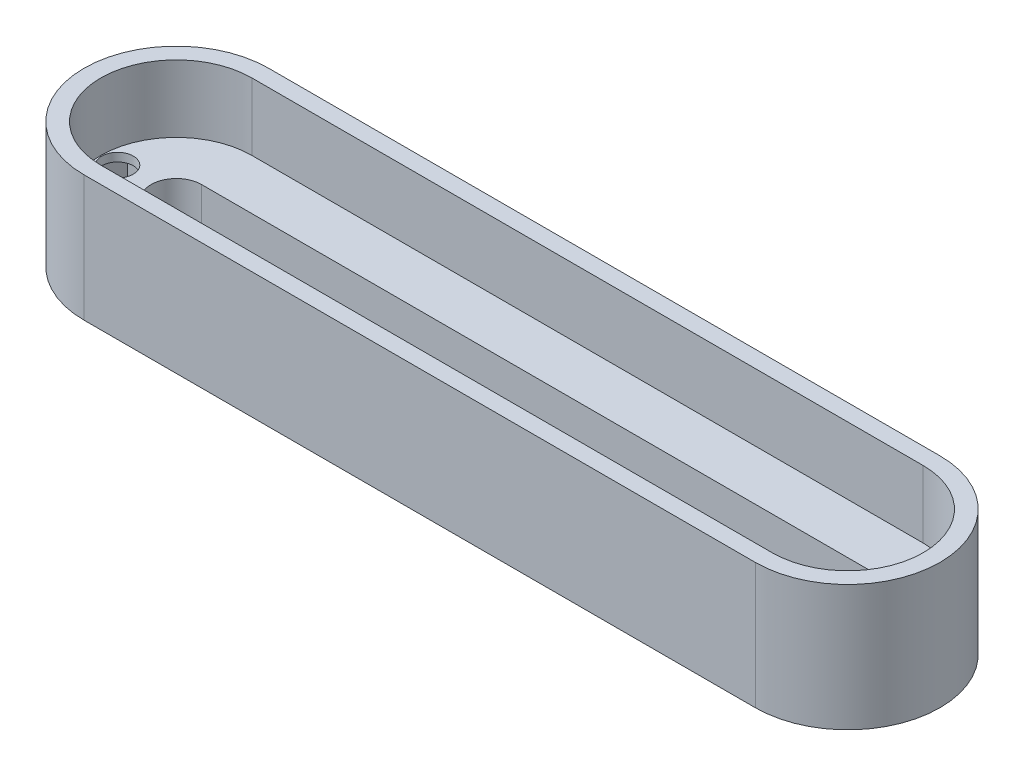
ISO-10303-21;
HEADER;
FILE_DESCRIPTION(('STEP AP214'),'2;1');
FILE_NAME('part.step','',(''),(''),'','','');
FILE_SCHEMA(('AUTOMOTIVE_DESIGN { 1 0 10303 214 1 1 1 1 }'));
ENDSEC;
DATA;
#1=APPLICATION_CONTEXT('core data for automotive mechanical design processes');
#2=APPLICATION_PROTOCOL_DEFINITION('international standard','automotive_design',2000,#1);
#3=PRODUCT_CONTEXT('',#1,'mechanical');
#4=PRODUCT('Part','Part','',(#3));
#5=PRODUCT_RELATED_PRODUCT_CATEGORY('part','',(#4));
#6=PRODUCT_DEFINITION_FORMATION('','',#4);
#7=PRODUCT_DEFINITION_CONTEXT('part definition',#1,'design');
#8=PRODUCT_DEFINITION('design','',#6,#7);
#9=PRODUCT_DEFINITION_SHAPE('','',#8);
#10=(LENGTH_UNIT() NAMED_UNIT(*) SI_UNIT(.MILLI.,.METRE.));
#11=(NAMED_UNIT(*) PLANE_ANGLE_UNIT() SI_UNIT($,.RADIAN.));
#12=(NAMED_UNIT(*) SI_UNIT($,.STERADIAN.) SOLID_ANGLE_UNIT());
#13=UNCERTAINTY_MEASURE_WITH_UNIT(LENGTH_MEASURE(1.E-05),#10,'distance_accuracy_value','');
#14=(GEOMETRIC_REPRESENTATION_CONTEXT(3) GLOBAL_UNCERTAINTY_ASSIGNED_CONTEXT((#13)) GLOBAL_UNIT_ASSIGNED_CONTEXT((#10,
#11,#12)) REPRESENTATION_CONTEXT('',''));
#15=CARTESIAN_POINT('',(0.,0.,0.));
#16=DIRECTION('',(0.,0.,1.));
#17=DIRECTION('',(1.,0.,0.));
#18=AXIS2_PLACEMENT_3D('',#15,#16,#17);
#19=CARTESIAN_POINT('',(-40.,12.,0.));
#20=DIRECTION('',(0.,-1.,0.));
#21=DIRECTION('',(0.,0.,-1.));
#22=AXIS2_PLACEMENT_3D('',#19,#20,#21);
#23=CYLINDRICAL_SURFACE('',#22,3.00000000000001);
#24=DIRECTION('',(0.,-1.,0.));
#25=VECTOR('',#24,1.);
#26=CARTESIAN_POINT('',(-40.,12.,-3.00000000000001));
#27=LINE('',#26,#25);
#28=CARTESIAN_POINT('',(-40.,7.,-3.00000000000001));
#29=VERTEX_POINT('',#28);
#30=CARTESIAN_POINT('',(-40.,0.,-3.00000000000001));
#31=VERTEX_POINT('',#30);
#32=EDGE_CURVE('E367',#29,#31,#27,.T.);
#33=ORIENTED_EDGE('',*,*,#32,.F.);
#34=CARTESIAN_POINT('',(-40.,7.,0.));
#35=DIRECTION('',(0.,1.,0.));
#36=DIRECTION('',(0.,0.,1.));
#37=AXIS2_PLACEMENT_3D('',#34,#35,#36);
#38=CIRCLE('',#37,3.00000000000001);
#39=CARTESIAN_POINT('',(-40.,7.,3.00000000000001));
#40=VERTEX_POINT('',#39);
#41=EDGE_CURVE('E51',#29,#40,#38,.T.);
#42=ORIENTED_EDGE('',*,*,#41,.T.);
#43=DIRECTION('',(0.,-1.,0.));
#44=VECTOR('',#43,1.);
#45=CARTESIAN_POINT('',(-40.,12.,3.00000000000001));
#46=LINE('',#45,#44);
#47=CARTESIAN_POINT('',(-40.,0.,3.00000000000001));
#48=VERTEX_POINT('',#47);
#49=EDGE_CURVE('E373',#40,#48,#46,.T.);
#50=ORIENTED_EDGE('',*,*,#49,.T.);
#51=CARTESIAN_POINT('',(-40.,0.,0.));
#52=DIRECTION('',(0.,1.,0.));
#53=DIRECTION('',(0.,0.,1.));
#54=AXIS2_PLACEMENT_3D('',#51,#52,#53);
#55=CIRCLE('',#54,3.00000000000001);
#56=EDGE_CURVE('E355',#31,#48,#55,.T.);
#57=ORIENTED_EDGE('',*,*,#56,.F.);
#58=EDGE_LOOP('',(#33,#42,#50,#57));
#59=FACE_BOUND('',#58,.T.);
#60=ADVANCED_FACE('F34',(#59),#23,.F.);
#61=CARTESIAN_POINT('',(-40.,12.,3.00000000000001));
#62=DIRECTION('',(0.,0.,-1.));
#63=DIRECTION('',(-1.,0.,0.));
#64=AXIS2_PLACEMENT_3D('',#61,#62,#63);
#65=PLANE('',#64);
#66=ORIENTED_EDGE('',*,*,#49,.F.);
#67=DIRECTION('',(1.,0.,0.));
#68=VECTOR('',#67,1.);
#69=CARTESIAN_POINT('',(-40.,7.,3.00000000000001));
#70=LINE('',#69,#68);
#71=CARTESIAN_POINT('',(40.,7.,3.));
#72=VERTEX_POINT('',#71);
#73=EDGE_CURVE('E244',#40,#72,#70,.T.);
#74=ORIENTED_EDGE('',*,*,#73,.T.);
#75=DIRECTION('',(0.,-1.,0.));
#76=VECTOR('',#75,1.);
#77=CARTESIAN_POINT('',(40.,12.,3.));
#78=LINE('',#77,#76);
#79=CARTESIAN_POINT('',(40.,0.,3.));
#80=VERTEX_POINT('',#79);
#81=EDGE_CURVE('E371',#72,#80,#78,.T.);
#82=ORIENTED_EDGE('',*,*,#81,.T.);
#83=DIRECTION('',(1.,0.,0.));
#84=VECTOR('',#83,1.);
#85=CARTESIAN_POINT('',(-40.,0.,3.00000000000001));
#86=LINE('',#85,#84);
#87=EDGE_CURVE('E358',#48,#80,#86,.T.);
#88=ORIENTED_EDGE('',*,*,#87,.F.);
#89=EDGE_LOOP('',(#66,#74,#82,#88));
#90=FACE_BOUND('',#89,.T.);
#91=ADVANCED_FACE('F471',(#90),#65,.T.);
#92=CARTESIAN_POINT('',(40.,12.,0.));
#93=DIRECTION('',(0.,-1.,0.));
#94=DIRECTION('',(0.,0.,-1.));
#95=AXIS2_PLACEMENT_3D('',#92,#93,#94);
#96=CYLINDRICAL_SURFACE('',#95,3.00000000000001);
#97=ORIENTED_EDGE('',*,*,#81,.F.);
#98=CARTESIAN_POINT('',(40.,7.,0.));
#99=DIRECTION('',(0.,1.,0.));
#100=DIRECTION('',(0.,0.,1.));
#101=AXIS2_PLACEMENT_3D('',#98,#99,#100);
#102=CIRCLE('',#101,3.00000000000001);
#103=CARTESIAN_POINT('',(40.,7.,-3.00000000000003));
#104=VERTEX_POINT('',#103);
#105=EDGE_CURVE('E241',#72,#104,#102,.T.);
#106=ORIENTED_EDGE('',*,*,#105,.T.);
#107=DIRECTION('',(0.,-1.,0.));
#108=VECTOR('',#107,1.);
#109=CARTESIAN_POINT('',(40.,12.,-3.00000000000003));
#110=LINE('',#109,#108);
#111=CARTESIAN_POINT('',(40.,0.,-3.00000000000003));
#112=VERTEX_POINT('',#111);
#113=EDGE_CURVE('E369',#104,#112,#110,.T.);
#114=ORIENTED_EDGE('',*,*,#113,.T.);
#115=CARTESIAN_POINT('',(40.,0.,0.));
#116=DIRECTION('',(0.,1.,0.));
#117=DIRECTION('',(0.,0.,1.));
#118=AXIS2_PLACEMENT_3D('',#115,#116,#117);
#119=CIRCLE('',#118,3.00000000000001);
#120=EDGE_CURVE('E361',#80,#112,#119,.T.);
#121=ORIENTED_EDGE('',*,*,#120,.F.);
#122=EDGE_LOOP('',(#97,#106,#114,#121));
#123=FACE_BOUND('',#122,.T.);
#124=ADVANCED_FACE('F477',(#123),#96,.F.);
#125=CARTESIAN_POINT('',(-40.,12.,-3.00000000000001));
#126=DIRECTION('',(0.,0.,1.));
#127=DIRECTION('',(1.,0.,0.));
#128=AXIS2_PLACEMENT_3D('',#125,#126,#127);
#129=PLANE('',#128);
#130=ORIENTED_EDGE('',*,*,#113,.F.);
#131=DIRECTION('',(-1.,0.,0.));
#132=VECTOR('',#131,1.);
#133=CARTESIAN_POINT('',(-40.,7.,-3.00000000000001));
#134=LINE('',#133,#132);
#135=EDGE_CURVE('E239',#104,#29,#134,.T.);
#136=ORIENTED_EDGE('',*,*,#135,.T.);
#137=ORIENTED_EDGE('',*,*,#32,.T.);
#138=DIRECTION('',(-1.,0.,0.));
#139=VECTOR('',#138,1.);
#140=CARTESIAN_POINT('',(-40.,0.,-3.00000000000001));
#141=LINE('',#140,#139);
#142=EDGE_CURVE('E364',#112,#31,#141,.T.);
#143=ORIENTED_EDGE('',*,*,#142,.F.);
#144=EDGE_LOOP('',(#130,#136,#137,#143));
#145=FACE_BOUND('',#144,.T.);
#146=ADVANCED_FACE('F525',(#145),#129,.T.);
#147=CARTESIAN_POINT('',(-47.,12.,0.));
#148=DIRECTION('',(0.,-1.,0.));
#149=DIRECTION('',(0.,0.,-1.));
#150=AXIS2_PLACEMENT_3D('',#147,#148,#149);
#151=CYLINDRICAL_SURFACE('',#150,1.875);
#152=CARTESIAN_POINT('',(-47.,6.,0.));
#153=DIRECTION('',(0.,1.,0.));
#154=DIRECTION('',(0.,0.,1.));
#155=AXIS2_PLACEMENT_3D('',#152,#153,#154);
#156=CIRCLE('',#155,1.875);
#157=CARTESIAN_POINT('',(-47.,6.,1.875));
#158=VERTEX_POINT('',#157);
#159=EDGE_CURVE('E265',#158,#158,#156,.T.);
#160=ORIENTED_EDGE('',*,*,#159,.F.);
#161=EDGE_LOOP('',(#160));
#162=FACE_BOUND('',#161,.T.);
#163=CARTESIAN_POINT('',(-47.,7.,0.));
#164=DIRECTION('',(0.,1.,0.));
#165=DIRECTION('',(0.,0.,1.));
#166=AXIS2_PLACEMENT_3D('',#163,#164,#165);
#167=CIRCLE('',#166,1.875);
#168=CARTESIAN_POINT('',(-47.,7.,1.875));
#169=VERTEX_POINT('',#168);
#170=EDGE_CURVE('E236',#169,#169,#167,.F.);
#171=ORIENTED_EDGE('',*,*,#170,.F.);
#172=EDGE_LOOP('',(#171));
#173=FACE_BOUND('',#172,.T.);
#174=ADVANCED_FACE('F522',(#162,#173),#151,.F.);
#175=CARTESIAN_POINT('',(47.,12.,0.));
#176=DIRECTION('',(0.,-1.,0.));
#177=DIRECTION('',(0.,0.,-1.));
#178=AXIS2_PLACEMENT_3D('',#175,#176,#177);
#179=CYLINDRICAL_SURFACE('',#178,1.875);
#180=CARTESIAN_POINT('',(47.,6.,0.));
#181=DIRECTION('',(0.,1.,0.));
#182=DIRECTION('',(0.,0.,1.));
#183=AXIS2_PLACEMENT_3D('',#180,#181,#182);
#184=CIRCLE('',#183,1.875);
#185=CARTESIAN_POINT('',(47.,6.,1.87500000000002));
#186=VERTEX_POINT('',#185);
#187=EDGE_CURVE('E260',#186,#186,#184,.F.);
#188=ORIENTED_EDGE('',*,*,#187,.T.);
#189=EDGE_LOOP('',(#188));
#190=FACE_BOUND('',#189,.T.);
#191=CARTESIAN_POINT('',(47.,7.,0.));
#192=DIRECTION('',(0.,1.,0.));
#193=DIRECTION('',(0.,0.,1.));
#194=AXIS2_PLACEMENT_3D('',#191,#192,#193);
#195=CIRCLE('',#194,1.875);
#196=CARTESIAN_POINT('',(47.,7.,1.87500000000002));
#197=VERTEX_POINT('',#196);
#198=EDGE_CURVE('E38',#197,#197,#195,.T.);
#199=ORIENTED_EDGE('',*,*,#198,.T.);
#200=EDGE_LOOP('',(#199));
#201=FACE_BOUND('',#200,.T.);
#202=ADVANCED_FACE('F396',(#190,#201),#179,.F.);
#203=CARTESIAN_POINT('',(-40.,0.,0.));
#204=DIRECTION('',(0.,1.,0.));
#205=DIRECTION('',(0.,0.,1.));
#206=AXIS2_PLACEMENT_3D('',#203,#204,#205);
#207=PLANE('',#206);
#208=ORIENTED_EDGE('',*,*,#56,.T.);
#209=ORIENTED_EDGE('',*,*,#87,.T.);
#210=ORIENTED_EDGE('',*,*,#120,.T.);
#211=ORIENTED_EDGE('',*,*,#142,.T.);
#212=EDGE_LOOP('',(#208,#209,#210,#211));
#213=FACE_BOUND('',#212,.T.);
#214=CARTESIAN_POINT('',(-40.,0.,0.));
#215=DIRECTION('',(0.,1.,0.));
#216=DIRECTION('',(0.,0.,1.));
#217=AXIS2_PLACEMENT_3D('',#214,#215,#216);
#218=CIRCLE('',#217,11.);
#219=CARTESIAN_POINT('',(-40.,0.,-11.));
#220=VERTEX_POINT('',#219);
#221=CARTESIAN_POINT('',(-40.,0.,11.));
#222=VERTEX_POINT('',#221);
#223=EDGE_CURVE('E375',#220,#222,#218,.T.);
#224=ORIENTED_EDGE('',*,*,#223,.F.);
#225=DIRECTION('',(-1.,0.,0.));
#226=VECTOR('',#225,1.);
#227=CARTESIAN_POINT('',(-40.,0.,-11.));
#228=LINE('',#227,#226);
#229=CARTESIAN_POINT('',(40.,0.,-11.));
#230=VERTEX_POINT('',#229);
#231=EDGE_CURVE('E382',#230,#220,#228,.T.);
#232=ORIENTED_EDGE('',*,*,#231,.F.);
#233=CARTESIAN_POINT('',(40.,0.,0.));
#234=DIRECTION('',(0.,1.,0.));
#235=DIRECTION('',(0.,0.,1.));
#236=AXIS2_PLACEMENT_3D('',#233,#234,#235);
#237=CIRCLE('',#236,11.);
#238=CARTESIAN_POINT('',(40.,0.,11.));
#239=VERTEX_POINT('',#238);
#240=EDGE_CURVE('E380',#239,#230,#237,.T.);
#241=ORIENTED_EDGE('',*,*,#240,.F.);
#242=DIRECTION('',(1.,0.,0.));
#243=VECTOR('',#242,1.);
#244=CARTESIAN_POINT('',(-40.,0.,11.));
#245=LINE('',#244,#243);
#246=EDGE_CURVE('E378',#222,#239,#245,.T.);
#247=ORIENTED_EDGE('',*,*,#246,.F.);
#248=EDGE_LOOP('',(#224,#232,#241,#247));
#249=FACE_BOUND('',#248,.T.);
#250=DIRECTION('',(0.499999999999999,0.,-0.866025403784439));
#251=VECTOR('',#250,1.);
#252=CARTESIAN_POINT('',(32.8500000000001,0.,18.9659563428792));
#253=LINE('',#252,#251);
#254=CARTESIAN_POINT('',(43.8,0.,0.));
#255=VERTEX_POINT('',#254);
#256=CARTESIAN_POINT('',(45.4,0.,-2.77128129211021));
#257=VERTEX_POINT('',#256);
#258=EDGE_CURVE('E312',#255,#257,#253,.T.);
#259=ORIENTED_EDGE('',*,*,#258,.F.);
#260=DIRECTION('',(-0.500000000000001,0.,-0.866025403784438));
#261=VECTOR('',#260,1.);
#262=CARTESIAN_POINT('',(32.85,0.,-18.9659563428792));
#263=LINE('',#262,#261);
#264=CARTESIAN_POINT('',(45.4,0.,2.77128129211019));
#265=VERTEX_POINT('',#264);
#266=EDGE_CURVE('E296',#265,#255,#263,.T.);
#267=ORIENTED_EDGE('',*,*,#266,.F.);
#268=DIRECTION('',(-1.,0.,0.));
#269=VECTOR('',#268,1.);
#270=CARTESIAN_POINT('',(0.,0.,2.77128129211018));
#271=LINE('',#270,#269);
#272=CARTESIAN_POINT('',(48.6,0.,2.77128129211019));
#273=VERTEX_POINT('',#272);
#274=EDGE_CURVE('E329',#273,#265,#271,.T.);
#275=ORIENTED_EDGE('',*,*,#274,.F.);
#276=DIRECTION('',(-0.499999999999999,0.,0.866025403784439));
#277=VECTOR('',#276,1.);
#278=CARTESIAN_POINT('',(37.65,0.,21.7372376349894));
#279=LINE('',#278,#277);
#280=CARTESIAN_POINT('',(50.2,0.,0.));
#281=VERTEX_POINT('',#280);
#282=EDGE_CURVE('E332',#281,#273,#279,.T.);
#283=ORIENTED_EDGE('',*,*,#282,.F.);
#284=DIRECTION('',(0.5,0.,0.866025403784438));
#285=VECTOR('',#284,1.);
#286=CARTESIAN_POINT('',(37.65,0.,-21.7372376349894));
#287=LINE('',#286,#285);
#288=CARTESIAN_POINT('',(48.6,0.,-2.77128129211021));
#289=VERTEX_POINT('',#288);
#290=EDGE_CURVE('E335',#289,#281,#287,.T.);
#291=ORIENTED_EDGE('',*,*,#290,.F.);
#292=DIRECTION('',(1.,0.,0.));
#293=VECTOR('',#292,1.);
#294=CARTESIAN_POINT('',(0.,0.,-2.7712812921102));
#295=LINE('',#294,#293);
#296=EDGE_CURVE('E338',#257,#289,#295,.T.);
#297=ORIENTED_EDGE('',*,*,#296,.F.);
#298=EDGE_LOOP('',(#259,#267,#275,#283,#291,#297));
#299=FACE_BOUND('',#298,.T.);
#300=DIRECTION('',(-0.499999999999999,0.,-0.866025403784439));
#301=VECTOR('',#300,1.);
#302=CARTESIAN_POINT('',(-43.8,0.,0.));
#303=LINE('',#302,#301);
#304=CARTESIAN_POINT('',(-43.8,0.,0.));
#305=VERTEX_POINT('',#304);
#306=CARTESIAN_POINT('',(-45.4,0.,-2.7712812921102));
#307=VERTEX_POINT('',#306);
#308=EDGE_CURVE('E293',#305,#307,#303,.T.);
#309=ORIENTED_EDGE('',*,*,#308,.T.);
#310=DIRECTION('',(-1.,0.,0.));
#311=VECTOR('',#310,1.);
#312=CARTESIAN_POINT('',(-45.4,0.,-2.7712812921102));
#313=LINE('',#312,#311);
#314=CARTESIAN_POINT('',(-48.6,0.,-2.7712812921102));
#315=VERTEX_POINT('',#314);
#316=EDGE_CURVE('E290',#307,#315,#313,.T.);
#317=ORIENTED_EDGE('',*,*,#316,.T.);
#318=DIRECTION('',(-0.5,0.,0.866025403784438));
#319=VECTOR('',#318,1.);
#320=CARTESIAN_POINT('',(-48.6,0.,-2.7712812921102));
#321=LINE('',#320,#319);
#322=CARTESIAN_POINT('',(-50.2,0.,0.));
#323=VERTEX_POINT('',#322);
#324=EDGE_CURVE('E287',#315,#323,#321,.T.);
#325=ORIENTED_EDGE('',*,*,#324,.T.);
#326=DIRECTION('',(0.499999999999999,0.,0.866025403784439));
#327=VECTOR('',#326,1.);
#328=CARTESIAN_POINT('',(-50.2,0.,0.));
#329=LINE('',#328,#327);
#330=CARTESIAN_POINT('',(-48.6,0.,2.7712812921102));
#331=VERTEX_POINT('',#330);
#332=EDGE_CURVE('E284',#323,#331,#329,.T.);
#333=ORIENTED_EDGE('',*,*,#332,.T.);
#334=DIRECTION('',(1.,0.,0.));
#335=VECTOR('',#334,1.);
#336=CARTESIAN_POINT('',(-48.6,0.,2.7712812921102));
#337=LINE('',#336,#335);
#338=CARTESIAN_POINT('',(-45.4,0.,2.7712812921102));
#339=VERTEX_POINT('',#338);
#340=EDGE_CURVE('E280',#331,#339,#337,.T.);
#341=ORIENTED_EDGE('',*,*,#340,.T.);
#342=DIRECTION('',(0.500000000000001,0.,-0.866025403784438));
#343=VECTOR('',#342,1.);
#344=CARTESIAN_POINT('',(-45.4,0.,2.7712812921102));
#345=LINE('',#344,#343);
#346=EDGE_CURVE('E277',#339,#305,#345,.T.);
#347=ORIENTED_EDGE('',*,*,#346,.T.);
#348=EDGE_LOOP('',(#309,#317,#325,#333,#341,#347));
#349=FACE_BOUND('',#348,.T.);
#350=ADVANCED_FACE('F429',(#213,#249,#299,#349),#207,.F.);
#351=CARTESIAN_POINT('',(-40.,12.,0.));
#352=DIRECTION('',(0.,-1.,0.));
#353=DIRECTION('',(0.,0.,-1.));
#354=AXIS2_PLACEMENT_3D('',#351,#352,#353);
#355=CYLINDRICAL_SURFACE('',#354,11.);
#356=ORIENTED_EDGE('',*,*,#223,.T.);
#357=DIRECTION('',(0.,-1.,0.));
#358=VECTOR('',#357,1.);
#359=CARTESIAN_POINT('',(-40.,12.,11.));
#360=LINE('',#359,#358);
#361=CARTESIAN_POINT('',(-40.,15.,11.));
#362=VERTEX_POINT('',#361);
#363=EDGE_CURVE('E11',#362,#222,#360,.T.);
#364=ORIENTED_EDGE('',*,*,#363,.F.);
#365=CARTESIAN_POINT('',(-40.,15.,0.));
#366=DIRECTION('',(0.,1.,0.));
#367=DIRECTION('',(0.,0.,1.));
#368=AXIS2_PLACEMENT_3D('',#365,#366,#367);
#369=CIRCLE('',#368,11.);
#370=CARTESIAN_POINT('',(-40.,15.,-11.));
#371=VERTEX_POINT('',#370);
#372=EDGE_CURVE('E257',#371,#362,#369,.T.);
#373=ORIENTED_EDGE('',*,*,#372,.F.);
#374=DIRECTION('',(0.,-1.,0.));
#375=VECTOR('',#374,1.);
#376=CARTESIAN_POINT('',(-40.,12.,-11.));
#377=LINE('',#376,#375);
#378=EDGE_CURVE('E384',#371,#220,#377,.T.);
#379=ORIENTED_EDGE('',*,*,#378,.T.);
#380=EDGE_LOOP('',(#356,#364,#373,#379));
#381=FACE_BOUND('',#380,.T.);
#382=ADVANCED_FACE('F36',(#381),#355,.T.);
#383=CARTESIAN_POINT('',(-40.,12.,11.));
#384=DIRECTION('',(0.,0.,-1.));
#385=DIRECTION('',(-1.,0.,0.));
#386=AXIS2_PLACEMENT_3D('',#383,#384,#385);
#387=PLANE('',#386);
#388=ORIENTED_EDGE('',*,*,#246,.T.);
#389=DIRECTION('',(0.,-1.,0.));
#390=VECTOR('',#389,1.);
#391=CARTESIAN_POINT('',(40.,12.,11.));
#392=LINE('',#391,#390);
#393=CARTESIAN_POINT('',(40.,15.,11.));
#394=VERTEX_POINT('',#393);
#395=EDGE_CURVE('E43',#394,#239,#392,.T.);
#396=ORIENTED_EDGE('',*,*,#395,.F.);
#397=DIRECTION('',(1.,0.,0.));
#398=VECTOR('',#397,1.);
#399=CARTESIAN_POINT('',(0.,15.,11.));
#400=LINE('',#399,#398);
#401=EDGE_CURVE('E248',#362,#394,#400,.T.);
#402=ORIENTED_EDGE('',*,*,#401,.F.);
#403=ORIENTED_EDGE('',*,*,#363,.T.);
#404=EDGE_LOOP('',(#388,#396,#402,#403));
#405=FACE_BOUND('',#404,.T.);
#406=ADVANCED_FACE('F489',(#405),#387,.F.);
#407=CARTESIAN_POINT('',(40.,12.,0.));
#408=DIRECTION('',(0.,-1.,0.));
#409=DIRECTION('',(0.,0.,-1.));
#410=AXIS2_PLACEMENT_3D('',#407,#408,#409);
#411=CYLINDRICAL_SURFACE('',#410,11.);
#412=ORIENTED_EDGE('',*,*,#240,.T.);
#413=DIRECTION('',(0.,-1.,0.));
#414=VECTOR('',#413,1.);
#415=CARTESIAN_POINT('',(40.,12.,-11.));
#416=LINE('',#415,#414);
#417=CARTESIAN_POINT('',(40.,15.,-11.));
#418=VERTEX_POINT('',#417);
#419=EDGE_CURVE('E387',#418,#230,#416,.T.);
#420=ORIENTED_EDGE('',*,*,#419,.F.);
#421=CARTESIAN_POINT('',(40.,15.,0.));
#422=DIRECTION('',(0.,1.,0.));
#423=DIRECTION('',(0.,0.,1.));
#424=AXIS2_PLACEMENT_3D('',#421,#422,#423);
#425=CIRCLE('',#424,11.);
#426=EDGE_CURVE('E251',#394,#418,#425,.T.);
#427=ORIENTED_EDGE('',*,*,#426,.F.);
#428=ORIENTED_EDGE('',*,*,#395,.T.);
#429=EDGE_LOOP('',(#412,#420,#427,#428));
#430=FACE_BOUND('',#429,.T.);
#431=ADVANCED_FACE('F486',(#430),#411,.T.);
#432=CARTESIAN_POINT('',(-40.,12.,-11.));
#433=DIRECTION('',(0.,0.,1.));
#434=DIRECTION('',(1.,0.,0.));
#435=AXIS2_PLACEMENT_3D('',#432,#433,#434);
#436=PLANE('',#435);
#437=ORIENTED_EDGE('',*,*,#231,.T.);
#438=ORIENTED_EDGE('',*,*,#378,.F.);
#439=DIRECTION('',(-1.,0.,0.));
#440=VECTOR('',#439,1.);
#441=CARTESIAN_POINT('',(0.,15.,-11.));
#442=LINE('',#441,#440);
#443=EDGE_CURVE('E254',#418,#371,#442,.T.);
#444=ORIENTED_EDGE('',*,*,#443,.F.);
#445=ORIENTED_EDGE('',*,*,#419,.T.);
#446=EDGE_LOOP('',(#437,#438,#444,#445));
#447=FACE_BOUND('',#446,.T.);
#448=ADVANCED_FACE('F483',(#447),#436,.F.);
#449=CARTESIAN_POINT('',(32.85,6.,-18.9659563428792));
#450=DIRECTION('',(-0.866025403784438,0.,0.500000000000001));
#451=DIRECTION('',(0.500000000000001,0.,0.866025403784438));
#452=AXIS2_PLACEMENT_3D('',#449,#450,#451);
#453=PLANE('',#452);
#454=ORIENTED_EDGE('',*,*,#266,.T.);
#455=DIRECTION('',(0.,-1.,0.));
#456=VECTOR('',#455,1.);
#457=CARTESIAN_POINT('',(43.8,6.,0.));
#458=LINE('',#457,#456);
#459=CARTESIAN_POINT('',(43.8,6.,0.));
#460=VERTEX_POINT('',#459);
#461=EDGE_CURVE('E327',#460,#255,#458,.T.);
#462=ORIENTED_EDGE('',*,*,#461,.F.);
#463=DIRECTION('',(-0.500000000000001,0.,-0.866025403784438));
#464=VECTOR('',#463,1.);
#465=CARTESIAN_POINT('',(32.85,6.,-18.9659563428792));
#466=LINE('',#465,#464);
#467=CARTESIAN_POINT('',(45.4,6.,2.77128129211019));
#468=VERTEX_POINT('',#467);
#469=EDGE_CURVE('E308',#468,#460,#466,.T.);
#470=ORIENTED_EDGE('',*,*,#469,.F.);
#471=DIRECTION('',(0.,-1.,0.));
#472=VECTOR('',#471,1.);
#473=CARTESIAN_POINT('',(45.4,6.,2.77128129211019));
#474=LINE('',#473,#472);
#475=EDGE_CURVE('E353',#468,#265,#474,.T.);
#476=ORIENTED_EDGE('',*,*,#475,.T.);
#477=EDGE_LOOP('',(#454,#462,#470,#476));
#478=FACE_BOUND('',#477,.T.);
#479=ADVANCED_FACE('F427',(#478),#453,.F.);
#480=CARTESIAN_POINT('',(0.,6.,2.77128129211018));
#481=DIRECTION('',(0.,0.,1.));
#482=DIRECTION('',(1.,0.,0.));
#483=AXIS2_PLACEMENT_3D('',#480,#481,#482);
#484=PLANE('',#483);
#485=ORIENTED_EDGE('',*,*,#274,.T.);
#486=ORIENTED_EDGE('',*,*,#475,.F.);
#487=DIRECTION('',(-1.,0.,0.));
#488=VECTOR('',#487,1.);
#489=CARTESIAN_POINT('',(0.,6.,2.77128129211018));
#490=LINE('',#489,#488);
#491=CARTESIAN_POINT('',(48.6,6.,2.77128129211019));
#492=VERTEX_POINT('',#491);
#493=EDGE_CURVE('E311',#492,#468,#490,.T.);
#494=ORIENTED_EDGE('',*,*,#493,.F.);
#495=DIRECTION('',(0.,-1.,0.));
#496=VECTOR('',#495,1.);
#497=CARTESIAN_POINT('',(48.6,6.,2.77128129211019));
#498=LINE('',#497,#496);
#499=EDGE_CURVE('E351',#492,#273,#498,.T.);
#500=ORIENTED_EDGE('',*,*,#499,.T.);
#501=EDGE_LOOP('',(#485,#486,#494,#500));
#502=FACE_BOUND('',#501,.T.);
#503=ADVANCED_FACE('F425',(#502),#484,.F.);
#504=CARTESIAN_POINT('',(37.65,6.,21.7372376349894));
#505=DIRECTION('',(0.866025403784439,0.,0.499999999999999));
#506=DIRECTION('',(0.499999999999999,0.,-0.866025403784439));
#507=AXIS2_PLACEMENT_3D('',#504,#505,#506);
#508=PLANE('',#507);
#509=ORIENTED_EDGE('',*,*,#282,.T.);
#510=ORIENTED_EDGE('',*,*,#499,.F.);
#511=DIRECTION('',(-0.499999999999999,0.,0.866025403784439));
#512=VECTOR('',#511,1.);
#513=CARTESIAN_POINT('',(37.65,6.,21.7372376349894));
#514=LINE('',#513,#512);
#515=CARTESIAN_POINT('',(50.2,6.,0.));
#516=VERTEX_POINT('',#515);
#517=EDGE_CURVE('E315',#516,#492,#514,.T.);
#518=ORIENTED_EDGE('',*,*,#517,.F.);
#519=DIRECTION('',(0.,-1.,0.));
#520=VECTOR('',#519,1.);
#521=CARTESIAN_POINT('',(50.2,6.,0.));
#522=LINE('',#521,#520);
#523=EDGE_CURVE('E349',#516,#281,#522,.T.);
#524=ORIENTED_EDGE('',*,*,#523,.T.);
#525=EDGE_LOOP('',(#509,#510,#518,#524));
#526=FACE_BOUND('',#525,.T.);
#527=ADVANCED_FACE('F422',(#526),#508,.F.);
#528=CARTESIAN_POINT('',(37.65,6.,-21.7372376349894));
#529=DIRECTION('',(0.866025403784438,0.,-0.500000000000001));
#530=DIRECTION('',(-0.500000000000001,0.,-0.866025403784438));
#531=AXIS2_PLACEMENT_3D('',#528,#529,#530);
#532=PLANE('',#531);
#533=ORIENTED_EDGE('',*,*,#290,.T.);
#534=ORIENTED_EDGE('',*,*,#523,.F.);
#535=DIRECTION('',(0.5,0.,0.866025403784438));
#536=VECTOR('',#535,1.);
#537=CARTESIAN_POINT('',(37.65,6.,-21.7372376349894));
#538=LINE('',#537,#536);
#539=CARTESIAN_POINT('',(48.6,6.,-2.77128129211021));
#540=VERTEX_POINT('',#539);
#541=EDGE_CURVE('E318',#540,#516,#538,.T.);
#542=ORIENTED_EDGE('',*,*,#541,.F.);
#543=DIRECTION('',(0.,-1.,0.));
#544=VECTOR('',#543,1.);
#545=CARTESIAN_POINT('',(48.6,6.,-2.77128129211021));
#546=LINE('',#545,#544);
#547=EDGE_CURVE('E347',#540,#289,#546,.T.);
#548=ORIENTED_EDGE('',*,*,#547,.T.);
#549=EDGE_LOOP('',(#533,#534,#542,#548));
#550=FACE_BOUND('',#549,.T.);
#551=ADVANCED_FACE('F418',(#550),#532,.F.);
#552=CARTESIAN_POINT('',(0.,6.,-2.7712812921102));
#553=DIRECTION('',(0.,0.,-1.));
#554=DIRECTION('',(-1.,0.,0.));
#555=AXIS2_PLACEMENT_3D('',#552,#553,#554);
#556=PLANE('',#555);
#557=ORIENTED_EDGE('',*,*,#296,.T.);
#558=ORIENTED_EDGE('',*,*,#547,.F.);
#559=DIRECTION('',(1.,0.,0.));
#560=VECTOR('',#559,1.);
#561=CARTESIAN_POINT('',(0.,6.,-2.7712812921102));
#562=LINE('',#561,#560);
#563=CARTESIAN_POINT('',(45.4,6.,-2.77128129211021));
#564=VERTEX_POINT('',#563);
#565=EDGE_CURVE('E321',#564,#540,#562,.T.);
#566=ORIENTED_EDGE('',*,*,#565,.F.);
#567=DIRECTION('',(0.,-1.,0.));
#568=VECTOR('',#567,1.);
#569=CARTESIAN_POINT('',(45.4,6.,-2.77128129211021));
#570=LINE('',#569,#568);
#571=EDGE_CURVE('E345',#564,#257,#570,.T.);
#572=ORIENTED_EDGE('',*,*,#571,.T.);
#573=EDGE_LOOP('',(#557,#558,#566,#572));
#574=FACE_BOUND('',#573,.T.);
#575=ADVANCED_FACE('F414',(#574),#556,.F.);
#576=CARTESIAN_POINT('',(32.8500000000001,6.,18.9659563428792));
#577=DIRECTION('',(-0.866025403784439,0.,-0.499999999999999));
#578=DIRECTION('',(-0.499999999999999,0.,0.866025403784439));
#579=AXIS2_PLACEMENT_3D('',#576,#577,#578);
#580=PLANE('',#579);
#581=ORIENTED_EDGE('',*,*,#258,.T.);
#582=ORIENTED_EDGE('',*,*,#571,.F.);
#583=DIRECTION('',(0.499999999999999,0.,-0.866025403784439));
#584=VECTOR('',#583,1.);
#585=CARTESIAN_POINT('',(32.8500000000001,6.,18.9659563428792));
#586=LINE('',#585,#584);
#587=EDGE_CURVE('E324',#460,#564,#586,.T.);
#588=ORIENTED_EDGE('',*,*,#587,.F.);
#589=ORIENTED_EDGE('',*,*,#461,.T.);
#590=EDGE_LOOP('',(#581,#582,#588,#589));
#591=FACE_BOUND('',#590,.T.);
#592=ADVANCED_FACE('F403',(#591),#580,.F.);
#593=CARTESIAN_POINT('',(0.,6.,0.));
#594=DIRECTION('',(0.,1.,0.));
#595=DIRECTION('',(0.,0.,1.));
#596=AXIS2_PLACEMENT_3D('',#593,#594,#595);
#597=PLANE('',#596);
#598=ORIENTED_EDGE('',*,*,#187,.F.);
#599=EDGE_LOOP('',(#598));
#600=FACE_BOUND('',#599,.T.);
#601=ORIENTED_EDGE('',*,*,#469,.T.);
#602=ORIENTED_EDGE('',*,*,#587,.T.);
#603=ORIENTED_EDGE('',*,*,#565,.T.);
#604=ORIENTED_EDGE('',*,*,#541,.T.);
#605=ORIENTED_EDGE('',*,*,#517,.T.);
#606=ORIENTED_EDGE('',*,*,#493,.T.);
#607=EDGE_LOOP('',(#601,#602,#603,#604,#605,#606));
#608=FACE_BOUND('',#607,.T.);
#609=ADVANCED_FACE('F399',(#600,#608),#597,.F.);
#610=CARTESIAN_POINT('',(-43.8,6.,0.));
#611=DIRECTION('',(-0.866025403784439,0.,0.499999999999999));
#612=DIRECTION('',(0.499999999999999,0.,0.866025403784439));
#613=AXIS2_PLACEMENT_3D('',#610,#611,#612);
#614=PLANE('',#613);
#615=ORIENTED_EDGE('',*,*,#308,.F.);
#616=DIRECTION('',(0.,-1.,0.));
#617=VECTOR('',#616,1.);
#618=CARTESIAN_POINT('',(-43.8,6.,0.));
#619=LINE('',#618,#617);
#620=CARTESIAN_POINT('',(-43.8,6.,0.));
#621=VERTEX_POINT('',#620);
#622=EDGE_CURVE('E273',#621,#305,#619,.T.);
#623=ORIENTED_EDGE('',*,*,#622,.F.);
#624=DIRECTION('',(-0.499999999999999,0.,-0.866025403784439));
#625=VECTOR('',#624,1.);
#626=CARTESIAN_POINT('',(-43.8,6.,0.));
#627=LINE('',#626,#625);
#628=CARTESIAN_POINT('',(-45.4,6.,-2.7712812921102));
#629=VERTEX_POINT('',#628);
#630=EDGE_CURVE('E281',#621,#629,#627,.T.);
#631=ORIENTED_EDGE('',*,*,#630,.T.);
#632=DIRECTION('',(0.,-1.,0.));
#633=VECTOR('',#632,1.);
#634=CARTESIAN_POINT('',(-45.4,6.,-2.7712812921102));
#635=LINE('',#634,#633);
#636=EDGE_CURVE('E261',#629,#307,#635,.T.);
#637=ORIENTED_EDGE('',*,*,#636,.T.);
#638=EDGE_LOOP('',(#615,#623,#631,#637));
#639=FACE_BOUND('',#638,.T.);
#640=ADVANCED_FACE('F402',(#639),#614,.T.);
#641=CARTESIAN_POINT('',(-45.4,6.,-2.7712812921102));
#642=DIRECTION('',(0.,0.,1.));
#643=DIRECTION('',(1.,0.,0.));
#644=AXIS2_PLACEMENT_3D('',#641,#642,#643);
#645=PLANE('',#644);
#646=ORIENTED_EDGE('',*,*,#316,.F.);
#647=ORIENTED_EDGE('',*,*,#636,.F.);
#648=DIRECTION('',(-1.,0.,0.));
#649=VECTOR('',#648,1.);
#650=CARTESIAN_POINT('',(-45.4,6.,-2.7712812921102));
#651=LINE('',#650,#649);
#652=CARTESIAN_POINT('',(-48.6,6.,-2.7712812921102));
#653=VERTEX_POINT('',#652);
#654=EDGE_CURVE('E304',#629,#653,#651,.T.);
#655=ORIENTED_EDGE('',*,*,#654,.T.);
#656=DIRECTION('',(0.,-1.,0.));
#657=VECTOR('',#656,1.);
#658=CARTESIAN_POINT('',(-48.6,6.,-2.7712812921102));
#659=LINE('',#658,#657);
#660=EDGE_CURVE('E264',#653,#315,#659,.T.);
#661=ORIENTED_EDGE('',*,*,#660,.T.);
#662=EDGE_LOOP('',(#646,#647,#655,#661));
#663=FACE_BOUND('',#662,.T.);
#664=ADVANCED_FACE('F449',(#663),#645,.T.);
#665=CARTESIAN_POINT('',(-48.6,6.,-2.7712812921102));
#666=DIRECTION('',(0.866025403784438,0.,0.5));
#667=DIRECTION('',(0.5,0.,-0.866025403784438));
#668=AXIS2_PLACEMENT_3D('',#665,#666,#667);
#669=PLANE('',#668);
#670=ORIENTED_EDGE('',*,*,#324,.F.);
#671=ORIENTED_EDGE('',*,*,#660,.F.);
#672=DIRECTION('',(-0.5,0.,0.866025403784438));
#673=VECTOR('',#672,1.);
#674=CARTESIAN_POINT('',(-48.6,6.,-2.7712812921102));
#675=LINE('',#674,#673);
#676=CARTESIAN_POINT('',(-50.2,6.,0.));
#677=VERTEX_POINT('',#676);
#678=EDGE_CURVE('E302',#653,#677,#675,.T.);
#679=ORIENTED_EDGE('',*,*,#678,.T.);
#680=DIRECTION('',(0.,-1.,0.));
#681=VECTOR('',#680,1.);
#682=CARTESIAN_POINT('',(-50.2,6.,0.));
#683=LINE('',#682,#681);
#684=EDGE_CURVE('E267',#677,#323,#683,.T.);
#685=ORIENTED_EDGE('',*,*,#684,.T.);
#686=EDGE_LOOP('',(#670,#671,#679,#685));
#687=FACE_BOUND('',#686,.T.);
#688=ADVANCED_FACE('F453',(#687),#669,.T.);
#689=CARTESIAN_POINT('',(-50.2,6.,0.));
#690=DIRECTION('',(0.866025403784439,0.,-0.499999999999999));
#691=DIRECTION('',(-0.499999999999999,0.,-0.866025403784439));
#692=AXIS2_PLACEMENT_3D('',#689,#690,#691);
#693=PLANE('',#692);
#694=ORIENTED_EDGE('',*,*,#332,.F.);
#695=ORIENTED_EDGE('',*,*,#684,.F.);
#696=DIRECTION('',(0.499999999999999,0.,0.866025403784439));
#697=VECTOR('',#696,1.);
#698=CARTESIAN_POINT('',(-50.2,6.,0.));
#699=LINE('',#698,#697);
#700=CARTESIAN_POINT('',(-48.6,6.,2.7712812921102));
#701=VERTEX_POINT('',#700);
#702=EDGE_CURVE('E300',#677,#701,#699,.T.);
#703=ORIENTED_EDGE('',*,*,#702,.T.);
#704=DIRECTION('',(0.,-1.,0.));
#705=VECTOR('',#704,1.);
#706=CARTESIAN_POINT('',(-48.6,6.,2.7712812921102));
#707=LINE('',#706,#705);
#708=EDGE_CURVE('E269',#701,#331,#707,.T.);
#709=ORIENTED_EDGE('',*,*,#708,.T.);
#710=EDGE_LOOP('',(#694,#695,#703,#709));
#711=FACE_BOUND('',#710,.T.);
#712=ADVANCED_FACE('F458',(#711),#693,.T.);
#713=CARTESIAN_POINT('',(-48.6,6.,2.7712812921102));
#714=DIRECTION('',(0.,0.,-1.));
#715=DIRECTION('',(-1.,0.,0.));
#716=AXIS2_PLACEMENT_3D('',#713,#714,#715);
#717=PLANE('',#716);
#718=ORIENTED_EDGE('',*,*,#340,.F.);
#719=ORIENTED_EDGE('',*,*,#708,.F.);
#720=DIRECTION('',(1.,0.,0.));
#721=VECTOR('',#720,1.);
#722=CARTESIAN_POINT('',(-48.6,6.,2.7712812921102));
#723=LINE('',#722,#721);
#724=CARTESIAN_POINT('',(-45.4,6.,2.7712812921102));
#725=VERTEX_POINT('',#724);
#726=EDGE_CURVE('E298',#701,#725,#723,.T.);
#727=ORIENTED_EDGE('',*,*,#726,.T.);
#728=DIRECTION('',(0.,-1.,0.));
#729=VECTOR('',#728,1.);
#730=CARTESIAN_POINT('',(-45.4,6.,2.7712812921102));
#731=LINE('',#730,#729);
#732=EDGE_CURVE('E271',#725,#339,#731,.T.);
#733=ORIENTED_EDGE('',*,*,#732,.T.);
#734=EDGE_LOOP('',(#718,#719,#727,#733));
#735=FACE_BOUND('',#734,.T.);
#736=ADVANCED_FACE('F461',(#735),#717,.T.);
#737=CARTESIAN_POINT('',(-45.4,6.,2.7712812921102));
#738=DIRECTION('',(-0.866025403784438,0.,-0.500000000000001));
#739=DIRECTION('',(-0.500000000000001,0.,0.866025403784438));
#740=AXIS2_PLACEMENT_3D('',#737,#738,#739);
#741=PLANE('',#740);
#742=ORIENTED_EDGE('',*,*,#346,.F.);
#743=ORIENTED_EDGE('',*,*,#732,.F.);
#744=DIRECTION('',(0.500000000000001,0.,-0.866025403784438));
#745=VECTOR('',#744,1.);
#746=CARTESIAN_POINT('',(-45.4,6.,2.7712812921102));
#747=LINE('',#746,#745);
#748=EDGE_CURVE('E276',#725,#621,#747,.T.);
#749=ORIENTED_EDGE('',*,*,#748,.T.);
#750=ORIENTED_EDGE('',*,*,#622,.T.);
#751=EDGE_LOOP('',(#742,#743,#749,#750));
#752=FACE_BOUND('',#751,.T.);
#753=ADVANCED_FACE('F440',(#752),#741,.T.);
#754=CARTESIAN_POINT('',(0.,6.,0.));
#755=DIRECTION('',(0.,1.,0.));
#756=DIRECTION('',(0.,0.,1.));
#757=AXIS2_PLACEMENT_3D('',#754,#755,#756);
#758=PLANE('',#757);
#759=ORIENTED_EDGE('',*,*,#159,.T.);
#760=EDGE_LOOP('',(#759));
#761=FACE_BOUND('',#760,.T.);
#762=ORIENTED_EDGE('',*,*,#630,.F.);
#763=ORIENTED_EDGE('',*,*,#748,.F.);
#764=ORIENTED_EDGE('',*,*,#726,.F.);
#765=ORIENTED_EDGE('',*,*,#702,.F.);
#766=ORIENTED_EDGE('',*,*,#678,.F.);
#767=ORIENTED_EDGE('',*,*,#654,.F.);
#768=EDGE_LOOP('',(#762,#763,#764,#765,#766,#767));
#769=FACE_BOUND('',#768,.T.);
#770=ADVANCED_FACE('F445',(#761,#769),#758,.F.);
#771=CARTESIAN_POINT('',(0.,15.,0.));
#772=DIRECTION('',(0.,1.,0.));
#773=DIRECTION('',(0.,0.,1.));
#774=AXIS2_PLACEMENT_3D('',#771,#772,#773);
#775=PLANE('',#774);
#776=CARTESIAN_POINT('',(-40.,15.,0.));
#777=DIRECTION('',(0.,1.,0.));
#778=DIRECTION('',(0.,0.,1.));
#779=AXIS2_PLACEMENT_3D('',#776,#777,#778);
#780=CIRCLE('',#779,9.);
#781=CARTESIAN_POINT('',(-40.,15.,-9.));
#782=VERTEX_POINT('',#781);
#783=CARTESIAN_POINT('',(-40.,15.,9.));
#784=VERTEX_POINT('',#783);
#785=EDGE_CURVE('E59',#782,#784,#780,.T.);
#786=ORIENTED_EDGE('',*,*,#785,.F.);
#787=DIRECTION('',(-1.,0.,0.));
#788=VECTOR('',#787,1.);
#789=CARTESIAN_POINT('',(-40.,15.,-9.));
#790=LINE('',#789,#788);
#791=CARTESIAN_POINT('',(40.,15.,-9.));
#792=VERTEX_POINT('',#791);
#793=EDGE_CURVE('E218',#792,#782,#790,.T.);
#794=ORIENTED_EDGE('',*,*,#793,.F.);
#795=CARTESIAN_POINT('',(40.,15.,0.));
#796=DIRECTION('',(0.,1.,0.));
#797=DIRECTION('',(0.,0.,1.));
#798=AXIS2_PLACEMENT_3D('',#795,#796,#797);
#799=CIRCLE('',#798,9.);
#800=CARTESIAN_POINT('',(40.,15.,8.99999999999999));
#801=VERTEX_POINT('',#800);
#802=EDGE_CURVE('E221',#801,#792,#799,.T.);
#803=ORIENTED_EDGE('',*,*,#802,.F.);
#804=DIRECTION('',(1.,0.,0.));
#805=VECTOR('',#804,1.);
#806=CARTESIAN_POINT('',(-40.,15.,9.));
#807=LINE('',#806,#805);
#808=EDGE_CURVE('E227',#784,#801,#807,.T.);
#809=ORIENTED_EDGE('',*,*,#808,.F.);
#810=EDGE_LOOP('',(#786,#794,#803,#809));
#811=FACE_BOUND('',#810,.T.);
#812=ORIENTED_EDGE('',*,*,#401,.T.);
#813=ORIENTED_EDGE('',*,*,#426,.T.);
#814=ORIENTED_EDGE('',*,*,#443,.T.);
#815=ORIENTED_EDGE('',*,*,#372,.T.);
#816=EDGE_LOOP('',(#812,#813,#814,#815));
#817=FACE_BOUND('',#816,.T.);
#818=ADVANCED_FACE('F506',(#811,#817),#775,.T.);
#819=CARTESIAN_POINT('',(-40.,7.,0.));
#820=DIRECTION('',(0.,1.,0.));
#821=DIRECTION('',(0.,0.,1.));
#822=AXIS2_PLACEMENT_3D('',#819,#820,#821);
#823=PLANE('',#822);
#824=ORIENTED_EDGE('',*,*,#135,.F.);
#825=ORIENTED_EDGE('',*,*,#105,.F.);
#826=ORIENTED_EDGE('',*,*,#73,.F.);
#827=ORIENTED_EDGE('',*,*,#41,.F.);
#828=EDGE_LOOP('',(#824,#825,#826,#827));
#829=FACE_BOUND('',#828,.T.);
#830=ORIENTED_EDGE('',*,*,#198,.F.);
#831=EDGE_LOOP('',(#830));
#832=FACE_BOUND('',#831,.T.);
#833=CARTESIAN_POINT('',(-40.,7.,0.));
#834=DIRECTION('',(0.,1.,0.));
#835=DIRECTION('',(0.,0.,1.));
#836=AXIS2_PLACEMENT_3D('',#833,#834,#835);
#837=CIRCLE('',#836,9.);
#838=CARTESIAN_POINT('',(-40.,7.,-9.));
#839=VERTEX_POINT('',#838);
#840=CARTESIAN_POINT('',(-40.,7.,9.));
#841=VERTEX_POINT('',#840);
#842=EDGE_CURVE('E199',#839,#841,#837,.T.);
#843=ORIENTED_EDGE('',*,*,#842,.T.);
#844=DIRECTION('',(1.,0.,0.));
#845=VECTOR('',#844,1.);
#846=CARTESIAN_POINT('',(-40.,7.,9.));
#847=LINE('',#846,#845);
#848=CARTESIAN_POINT('',(40.,7.,8.99999999999999));
#849=VERTEX_POINT('',#848);
#850=EDGE_CURVE('E208',#841,#849,#847,.T.);
#851=ORIENTED_EDGE('',*,*,#850,.T.);
#852=CARTESIAN_POINT('',(40.,7.,0.));
#853=DIRECTION('',(0.,1.,0.));
#854=DIRECTION('',(0.,0.,1.));
#855=AXIS2_PLACEMENT_3D('',#852,#853,#854);
#856=CIRCLE('',#855,9.);
#857=CARTESIAN_POINT('',(40.,7.,-9.));
#858=VERTEX_POINT('',#857);
#859=EDGE_CURVE('E213',#849,#858,#856,.T.);
#860=ORIENTED_EDGE('',*,*,#859,.T.);
#861=DIRECTION('',(-1.,0.,0.));
#862=VECTOR('',#861,1.);
#863=CARTESIAN_POINT('',(-40.,7.,-9.));
#864=LINE('',#863,#862);
#865=EDGE_CURVE('E205',#858,#839,#864,.T.);
#866=ORIENTED_EDGE('',*,*,#865,.T.);
#867=EDGE_LOOP('',(#843,#851,#860,#866));
#868=FACE_BOUND('',#867,.T.);
#869=ORIENTED_EDGE('',*,*,#170,.T.);
#870=EDGE_LOOP('',(#869));
#871=FACE_BOUND('',#870,.T.);
#872=ADVANCED_FACE('F215',(#829,#832,#868,#871),#823,.T.);
#873=CARTESIAN_POINT('',(-40.,7.,0.));
#874=DIRECTION('',(0.,1.,0.));
#875=DIRECTION('',(0.,0.,1.));
#876=AXIS2_PLACEMENT_3D('',#873,#874,#875);
#877=CYLINDRICAL_SURFACE('',#876,9.);
#878=ORIENTED_EDGE('',*,*,#785,.T.);
#879=DIRECTION('',(0.,1.,0.));
#880=VECTOR('',#879,1.);
#881=CARTESIAN_POINT('',(-40.,7.,9.));
#882=LINE('',#881,#880);
#883=EDGE_CURVE('E195',#841,#784,#882,.T.);
#884=ORIENTED_EDGE('',*,*,#883,.F.);
#885=ORIENTED_EDGE('',*,*,#842,.F.);
#886=DIRECTION('',(0.,1.,0.));
#887=VECTOR('',#886,1.);
#888=CARTESIAN_POINT('',(-40.,7.,-9.));
#889=LINE('',#888,#887);
#890=EDGE_CURVE('E231',#839,#782,#889,.T.);
#891=ORIENTED_EDGE('',*,*,#890,.T.);
#892=EDGE_LOOP('',(#878,#884,#885,#891));
#893=FACE_BOUND('',#892,.T.);
#894=ADVANCED_FACE('F197',(#893),#877,.F.);
#895=CARTESIAN_POINT('',(-40.,7.,-9.));
#896=DIRECTION('',(0.,0.,-1.));
#897=DIRECTION('',(-1.,0.,0.));
#898=AXIS2_PLACEMENT_3D('',#895,#896,#897);
#899=PLANE('',#898);
#900=ORIENTED_EDGE('',*,*,#793,.T.);
#901=ORIENTED_EDGE('',*,*,#890,.F.);
#902=ORIENTED_EDGE('',*,*,#865,.F.);
#903=DIRECTION('',(0.,1.,0.));
#904=VECTOR('',#903,1.);
#905=CARTESIAN_POINT('',(40.,7.,-9.));
#906=LINE('',#905,#904);
#907=EDGE_CURVE('E233',#858,#792,#906,.T.);
#908=ORIENTED_EDGE('',*,*,#907,.T.);
#909=EDGE_LOOP('',(#900,#901,#902,#908));
#910=FACE_BOUND('',#909,.T.);
#911=ADVANCED_FACE('F664',(#910),#899,.F.);
#912=CARTESIAN_POINT('',(40.,7.,0.));
#913=DIRECTION('',(0.,1.,0.));
#914=DIRECTION('',(0.,0.,1.));
#915=AXIS2_PLACEMENT_3D('',#912,#913,#914);
#916=CYLINDRICAL_SURFACE('',#915,9.);
#917=ORIENTED_EDGE('',*,*,#802,.T.);
#918=ORIENTED_EDGE('',*,*,#907,.F.);
#919=ORIENTED_EDGE('',*,*,#859,.F.);
#920=DIRECTION('',(0.,1.,0.));
#921=VECTOR('',#920,1.);
#922=CARTESIAN_POINT('',(40.,7.,8.99999999999999));
#923=LINE('',#922,#921);
#924=EDGE_CURVE('E204',#849,#801,#923,.T.);
#925=ORIENTED_EDGE('',*,*,#924,.T.);
#926=EDGE_LOOP('',(#917,#918,#919,#925));
#927=FACE_BOUND('',#926,.T.);
#928=ADVANCED_FACE('F672',(#927),#916,.F.);
#929=CARTESIAN_POINT('',(-40.,7.,9.));
#930=DIRECTION('',(0.,0.,1.));
#931=DIRECTION('',(1.,0.,0.));
#932=AXIS2_PLACEMENT_3D('',#929,#930,#931);
#933=PLANE('',#932);
#934=ORIENTED_EDGE('',*,*,#808,.T.);
#935=ORIENTED_EDGE('',*,*,#924,.F.);
#936=ORIENTED_EDGE('',*,*,#850,.F.);
#937=ORIENTED_EDGE('',*,*,#883,.T.);
#938=EDGE_LOOP('',(#934,#935,#936,#937));
#939=FACE_BOUND('',#938,.T.);
#940=ADVANCED_FACE('F209',(#939),#933,.F.);
#941=CLOSED_SHELL('',(#60,#91,#124,#146,#174,#202,#350,#382,#406,#431,#448,#479,#503,#527,#551,
#575,#592,#609,#640,#664,#688,#712,#736,#753,#770,#818,#872,#894,#911,#928,#940));
#942=MANIFOLD_SOLID_BREP('B2',#941);
#943=ADVANCED_BREP_SHAPE_REPRESENTATION('',(#18,#942),#14);
#944=SHAPE_DEFINITION_REPRESENTATION(#9,#943);
ENDSEC;
END-ISO-10303-21;
